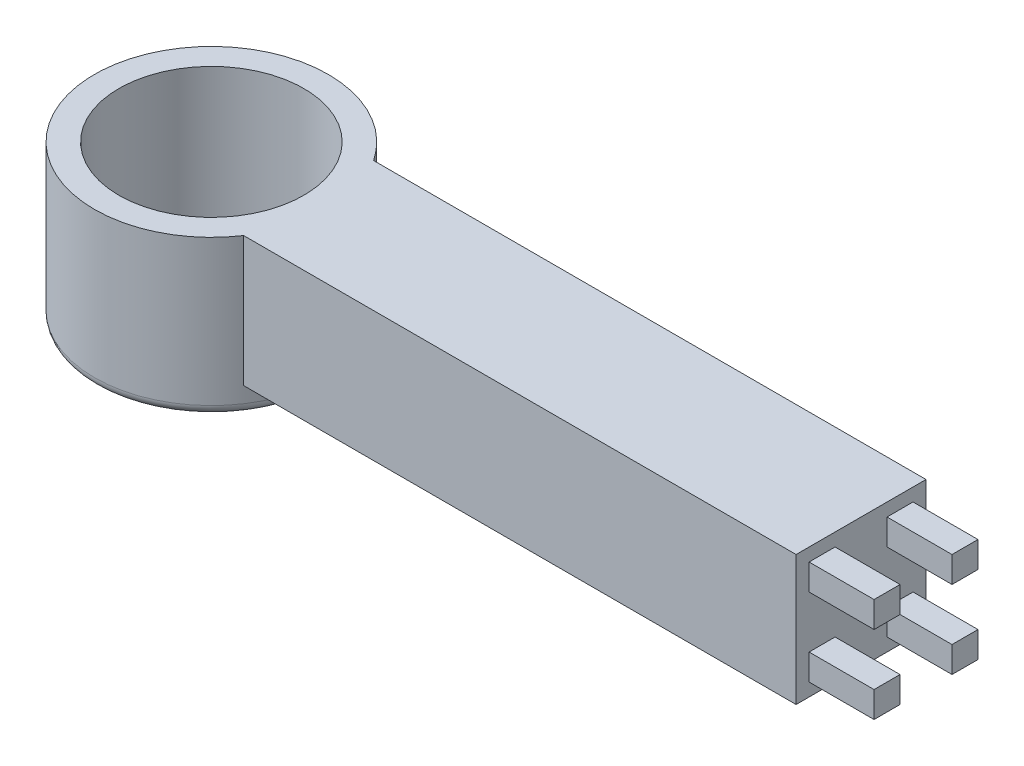
ISO-10303-21;
HEADER;
FILE_DESCRIPTION(('STEP AP214'),'2;1');
FILE_NAME('part.step','',(''),(''),'','','');
FILE_SCHEMA(('AUTOMOTIVE_DESIGN { 1 0 10303 214 1 1 1 1 }'));
ENDSEC;
DATA;
#1=APPLICATION_CONTEXT('core data for automotive mechanical design processes');
#2=APPLICATION_PROTOCOL_DEFINITION('international standard','automotive_design',2000,#1);
#3=PRODUCT_CONTEXT('',#1,'mechanical');
#4=PRODUCT('Part','Part','',(#3));
#5=PRODUCT_RELATED_PRODUCT_CATEGORY('part','',(#4));
#6=PRODUCT_DEFINITION_FORMATION('','',#4);
#7=PRODUCT_DEFINITION_CONTEXT('part definition',#1,'design');
#8=PRODUCT_DEFINITION('design','',#6,#7);
#9=PRODUCT_DEFINITION_SHAPE('','',#8);
#10=(LENGTH_UNIT() NAMED_UNIT(*) SI_UNIT(.MILLI.,.METRE.));
#11=(NAMED_UNIT(*) PLANE_ANGLE_UNIT() SI_UNIT($,.RADIAN.));
#12=(NAMED_UNIT(*) SI_UNIT($,.STERADIAN.) SOLID_ANGLE_UNIT());
#13=UNCERTAINTY_MEASURE_WITH_UNIT(LENGTH_MEASURE(1.E-05),#10,'distance_accuracy_value','');
#14=(GEOMETRIC_REPRESENTATION_CONTEXT(3) GLOBAL_UNCERTAINTY_ASSIGNED_CONTEXT((#13)) GLOBAL_UNIT_ASSIGNED_CONTEXT((#10,
#11,#12)) REPRESENTATION_CONTEXT('',''));
#15=CARTESIAN_POINT('',(0.,0.,0.));
#16=DIRECTION('',(0.,0.,1.));
#17=DIRECTION('',(1.,0.,0.));
#18=AXIS2_PLACEMENT_3D('',#15,#16,#17);
#19=CARTESIAN_POINT('',(635.,0.,127.));
#20=DIRECTION('',(-1.,0.,0.));
#21=DIRECTION('',(0.,0.,1.));
#22=AXIS2_PLACEMENT_3D('',#19,#20,#21);
#23=PLANE('',#22);
#24=DIRECTION('',(0.,1.,0.));
#25=VECTOR('',#24,1.);
#26=CARTESIAN_POINT('',(635.,88.9,88.9));
#27=LINE('',#26,#25);
#28=CARTESIAN_POINT('',(635.,88.9,88.9));
#29=VERTEX_POINT('',#28);
#30=CARTESIAN_POINT('',(635.,114.3,88.9));
#31=VERTEX_POINT('',#30);
#32=EDGE_CURVE('E191',#29,#31,#27,.T.);
#33=ORIENTED_EDGE('',*,*,#32,.F.);
#34=DIRECTION('',(0.,0.,-1.));
#35=VECTOR('',#34,1.);
#36=CARTESIAN_POINT('',(635.,88.9,114.3));
#37=LINE('',#36,#35);
#38=CARTESIAN_POINT('',(635.,88.9,114.3));
#39=VERTEX_POINT('',#38);
#40=EDGE_CURVE('E204',#39,#29,#37,.T.);
#41=ORIENTED_EDGE('',*,*,#40,.F.);
#42=DIRECTION('',(0.,-1.,0.));
#43=VECTOR('',#42,1.);
#44=CARTESIAN_POINT('',(635.,88.9,114.3));
#45=LINE('',#44,#43);
#46=CARTESIAN_POINT('',(635.,114.3,114.3));
#47=VERTEX_POINT('',#46);
#48=EDGE_CURVE('E213',#47,#39,#45,.T.);
#49=ORIENTED_EDGE('',*,*,#48,.F.);
#50=DIRECTION('',(0.,0.,1.));
#51=VECTOR('',#50,1.);
#52=CARTESIAN_POINT('',(635.,114.3,114.3));
#53=LINE('',#52,#51);
#54=EDGE_CURVE('E194',#31,#47,#53,.T.);
#55=ORIENTED_EDGE('',*,*,#54,.F.);
#56=EDGE_LOOP('',(#33,#41,#49,#55));
#57=FACE_BOUND('',#56,.T.);
#58=DIRECTION('',(0.,-1.,0.));
#59=VECTOR('',#58,1.);
#60=CARTESIAN_POINT('',(635.,12.7,114.3));
#61=LINE('',#60,#59);
#62=CARTESIAN_POINT('',(635.,38.1,114.3));
#63=VERTEX_POINT('',#62);
#64=CARTESIAN_POINT('',(635.,12.7,114.3));
#65=VERTEX_POINT('',#64);
#66=EDGE_CURVE('E262',#63,#65,#61,.T.);
#67=ORIENTED_EDGE('',*,*,#66,.F.);
#68=DIRECTION('',(0.,0.,1.));
#69=VECTOR('',#68,1.);
#70=CARTESIAN_POINT('',(635.,38.1,114.3));
#71=LINE('',#70,#69);
#72=CARTESIAN_POINT('',(635.,38.1,88.9));
#73=VERTEX_POINT('',#72);
#74=EDGE_CURVE('E267',#73,#63,#71,.T.);
#75=ORIENTED_EDGE('',*,*,#74,.F.);
#76=DIRECTION('',(0.,1.,0.));
#77=VECTOR('',#76,1.);
#78=CARTESIAN_POINT('',(635.,12.7,88.9));
#79=LINE('',#78,#77);
#80=CARTESIAN_POINT('',(635.,12.7,88.9));
#81=VERTEX_POINT('',#80);
#82=EDGE_CURVE('E279',#81,#73,#79,.T.);
#83=ORIENTED_EDGE('',*,*,#82,.F.);
#84=DIRECTION('',(0.,0.,-1.));
#85=VECTOR('',#84,1.);
#86=CARTESIAN_POINT('',(635.,12.7,114.3));
#87=LINE('',#86,#85);
#88=EDGE_CURVE('E276',#65,#81,#87,.T.);
#89=ORIENTED_EDGE('',*,*,#88,.F.);
#90=EDGE_LOOP('',(#67,#75,#83,#89));
#91=FACE_BOUND('',#90,.T.);
#92=DIRECTION('',(0.,1.,0.));
#93=VECTOR('',#92,1.);
#94=CARTESIAN_POINT('',(635.,0.,0.));
#95=LINE('',#94,#93);
#96=CARTESIAN_POINT('',(635.,0.,0.));
#97=VERTEX_POINT('',#96);
#98=CARTESIAN_POINT('',(635.,127.,0.));
#99=VERTEX_POINT('',#98);
#100=EDGE_CURVE('E318',#97,#99,#95,.T.);
#101=ORIENTED_EDGE('',*,*,#100,.T.);
#102=DIRECTION('',(0.,0.,-1.));
#103=VECTOR('',#102,1.);
#104=CARTESIAN_POINT('',(635.,127.,127.));
#105=LINE('',#104,#103);
#106=CARTESIAN_POINT('',(635.,127.,127.));
#107=VERTEX_POINT('',#106);
#108=EDGE_CURVE('E316',#107,#99,#105,.T.);
#109=ORIENTED_EDGE('',*,*,#108,.F.);
#110=DIRECTION('',(0.,1.,0.));
#111=VECTOR('',#110,1.);
#112=CARTESIAN_POINT('',(635.,0.,127.));
#113=LINE('',#112,#111);
#114=CARTESIAN_POINT('',(635.,0.,127.));
#115=VERTEX_POINT('',#114);
#116=EDGE_CURVE('E310',#115,#107,#113,.T.);
#117=ORIENTED_EDGE('',*,*,#116,.F.);
#118=DIRECTION('',(0.,0.,-1.));
#119=VECTOR('',#118,1.);
#120=CARTESIAN_POINT('',(635.,0.,127.));
#121=LINE('',#120,#119);
#122=EDGE_CURVE('E324',#115,#97,#121,.T.);
#123=ORIENTED_EDGE('',*,*,#122,.T.);
#124=EDGE_LOOP('',(#101,#109,#117,#123));
#125=FACE_BOUND('',#124,.T.);
#126=DIRECTION('',(0.,1.,0.));
#127=VECTOR('',#126,1.);
#128=CARTESIAN_POINT('',(635.,12.7,12.7));
#129=LINE('',#128,#127);
#130=CARTESIAN_POINT('',(635.,12.7,12.7));
#131=VERTEX_POINT('',#130);
#132=CARTESIAN_POINT('',(635.,38.1,12.7));
#133=VERTEX_POINT('',#132);
#134=EDGE_CURVE('E229',#131,#133,#129,.T.);
#135=ORIENTED_EDGE('',*,*,#134,.F.);
#136=DIRECTION('',(0.,0.,-1.));
#137=VECTOR('',#136,1.);
#138=CARTESIAN_POINT('',(635.,12.7,12.7));
#139=LINE('',#138,#137);
#140=CARTESIAN_POINT('',(635.,12.7,38.1));
#141=VERTEX_POINT('',#140);
#142=EDGE_CURVE('E234',#141,#131,#139,.T.);
#143=ORIENTED_EDGE('',*,*,#142,.F.);
#144=DIRECTION('',(0.,-1.,0.));
#145=VECTOR('',#144,1.);
#146=CARTESIAN_POINT('',(635.,12.7,38.1));
#147=LINE('',#146,#145);
#148=CARTESIAN_POINT('',(635.,38.1,38.1));
#149=VERTEX_POINT('',#148);
#150=EDGE_CURVE('E246',#149,#141,#147,.T.);
#151=ORIENTED_EDGE('',*,*,#150,.F.);
#152=DIRECTION('',(0.,0.,1.));
#153=VECTOR('',#152,1.);
#154=CARTESIAN_POINT('',(635.,38.1,12.7));
#155=LINE('',#154,#153);
#156=EDGE_CURVE('E243',#133,#149,#155,.T.);
#157=ORIENTED_EDGE('',*,*,#156,.F.);
#158=EDGE_LOOP('',(#135,#143,#151,#157));
#159=FACE_BOUND('',#158,.T.);
#160=DIRECTION('',(0.,1.,0.));
#161=VECTOR('',#160,1.);
#162=CARTESIAN_POINT('',(635.,114.3,12.7));
#163=LINE('',#162,#161);
#164=CARTESIAN_POINT('',(635.,88.9,12.7));
#165=VERTEX_POINT('',#164);
#166=CARTESIAN_POINT('',(635.,114.3,12.7));
#167=VERTEX_POINT('',#166);
#168=EDGE_CURVE('E190',#165,#167,#163,.T.);
#169=ORIENTED_EDGE('',*,*,#168,.F.);
#170=DIRECTION('',(0.,0.,-1.));
#171=VECTOR('',#170,1.);
#172=CARTESIAN_POINT('',(635.,88.9,12.7));
#173=LINE('',#172,#171);
#174=CARTESIAN_POINT('',(635.,88.9,38.1));
#175=VERTEX_POINT('',#174);
#176=EDGE_CURVE('E187',#175,#165,#173,.T.);
#177=ORIENTED_EDGE('',*,*,#176,.F.);
#178=DIRECTION('',(0.,-1.,0.));
#179=VECTOR('',#178,1.);
#180=CARTESIAN_POINT('',(635.,114.3,38.1));
#181=LINE('',#180,#179);
#182=CARTESIAN_POINT('',(635.,114.3,38.1));
#183=VERTEX_POINT('',#182);
#184=EDGE_CURVE('E53',#183,#175,#181,.T.);
#185=ORIENTED_EDGE('',*,*,#184,.F.);
#186=DIRECTION('',(0.,0.,1.));
#187=VECTOR('',#186,1.);
#188=CARTESIAN_POINT('',(635.,114.3,12.7));
#189=LINE('',#188,#187);
#190=EDGE_CURVE('E48',#167,#183,#189,.T.);
#191=ORIENTED_EDGE('',*,*,#190,.F.);
#192=EDGE_LOOP('',(#169,#177,#185,#191));
#193=FACE_BOUND('',#192,.T.);
#194=ADVANCED_FACE('F33',(#57,#91,#125,#159,#193),#23,.F.);
#195=CARTESIAN_POINT('',(0.,0.,127.));
#196=DIRECTION('',(0.,1.,0.));
#197=DIRECTION('',(0.,0.,1.));
#198=AXIS2_PLACEMENT_3D('',#195,#196,#197);
#199=PLANE('',#198);
#200=DIRECTION('',(1.,0.,0.));
#201=VECTOR('',#200,1.);
#202=CARTESIAN_POINT('',(0.,0.,127.));
#203=LINE('',#202,#201);
#204=CARTESIAN_POINT('',(95.0380976240581,0.,127.));
#205=VERTEX_POINT('',#204);
#206=EDGE_CURVE('E308',#205,#115,#203,.T.);
#207=ORIENTED_EDGE('',*,*,#206,.F.);
#208=CARTESIAN_POINT('',(0.,0.,63.5));
#209=DIRECTION('',(0.,1.,0.));
#210=DIRECTION('',(0.,0.,1.));
#211=AXIS2_PLACEMENT_3D('',#208,#209,#210);
#212=CIRCLE('',#211,114.3);
#213=CARTESIAN_POINT('',(95.0380976240581,0.,0.));
#214=VERTEX_POINT('',#213);
#215=EDGE_CURVE('E301',#205,#214,#212,.T.);
#216=ORIENTED_EDGE('',*,*,#215,.T.);
#217=DIRECTION('',(1.,0.,0.));
#218=VECTOR('',#217,1.);
#219=CARTESIAN_POINT('',(0.,0.,0.));
#220=LINE('',#219,#218);
#221=EDGE_CURVE('E307',#214,#97,#220,.T.);
#222=ORIENTED_EDGE('',*,*,#221,.T.);
#223=ORIENTED_EDGE('',*,*,#122,.F.);
#224=EDGE_LOOP('',(#207,#216,#222,#223));
#225=FACE_BOUND('',#224,.T.);
#226=ADVANCED_FACE('F379',(#225),#199,.F.);
#227=CARTESIAN_POINT('',(0.,127.,127.));
#228=DIRECTION('',(0.,-1.,0.));
#229=DIRECTION('',(0.,0.,-1.));
#230=AXIS2_PLACEMENT_3D('',#227,#228,#229);
#231=PLANE('',#230);
#232=DIRECTION('',(-1.,0.,0.));
#233=VECTOR('',#232,1.);
#234=CARTESIAN_POINT('',(0.,127.,0.));
#235=LINE('',#234,#233);
#236=CARTESIAN_POINT('',(95.0380976240581,127.,0.));
#237=VERTEX_POINT('',#236);
#238=EDGE_CURVE('E311',#99,#237,#235,.T.);
#239=ORIENTED_EDGE('',*,*,#238,.T.);
#240=CARTESIAN_POINT('',(0.,127.,63.5));
#241=DIRECTION('',(0.,1.,0.));
#242=DIRECTION('',(0.,0.,1.));
#243=AXIS2_PLACEMENT_3D('',#240,#241,#242);
#244=CIRCLE('',#243,114.3);
#245=CARTESIAN_POINT('',(95.0380976240581,127.,127.));
#246=VERTEX_POINT('',#245);
#247=EDGE_CURVE('E298',#237,#246,#244,.T.);
#248=ORIENTED_EDGE('',*,*,#247,.T.);
#249=DIRECTION('',(-1.,0.,0.));
#250=VECTOR('',#249,1.);
#251=CARTESIAN_POINT('',(0.,127.,127.));
#252=LINE('',#251,#250);
#253=EDGE_CURVE('E313',#107,#246,#252,.T.);
#254=ORIENTED_EDGE('',*,*,#253,.F.);
#255=ORIENTED_EDGE('',*,*,#108,.T.);
#256=EDGE_LOOP('',(#239,#248,#254,#255));
#257=FACE_BOUND('',#256,.T.);
#258=CARTESIAN_POINT('',(0.,127.,63.5));
#259=DIRECTION('',(0.,1.,0.));
#260=DIRECTION('',(0.,0.,1.));
#261=AXIS2_PLACEMENT_3D('',#258,#259,#260);
#262=CIRCLE('',#261,90.424);
#263=CARTESIAN_POINT('',(0.,127.,153.924));
#264=VERTEX_POINT('',#263);
#265=EDGE_CURVE('E295',#264,#264,#262,.T.);
#266=ORIENTED_EDGE('',*,*,#265,.F.);
#267=EDGE_LOOP('',(#266));
#268=FACE_BOUND('',#267,.T.);
#269=ADVANCED_FACE('F366',(#257,#268),#231,.F.);
#270=CARTESIAN_POINT('',(0.,0.,127.));
#271=DIRECTION('',(0.,0.,-1.));
#272=DIRECTION('',(-1.,0.,0.));
#273=AXIS2_PLACEMENT_3D('',#270,#271,#272);
#274=PLANE('',#273);
#275=ORIENTED_EDGE('',*,*,#253,.T.);
#276=DIRECTION('',(0.,1.,0.));
#277=VECTOR('',#276,1.);
#278=CARTESIAN_POINT('',(95.0380976240581,-25.3999999999998,127.));
#279=LINE('',#278,#277);
#280=EDGE_CURVE('E304',#246,#205,#279,.F.);
#281=ORIENTED_EDGE('',*,*,#280,.T.);
#282=ORIENTED_EDGE('',*,*,#206,.T.);
#283=ORIENTED_EDGE('',*,*,#116,.T.);
#284=EDGE_LOOP('',(#275,#281,#282,#283));
#285=FACE_BOUND('',#284,.T.);
#286=ADVANCED_FACE('F369',(#285),#274,.F.);
#287=CARTESIAN_POINT('',(0.,0.,0.));
#288=DIRECTION('',(0.,0.,-1.));
#289=DIRECTION('',(-1.,0.,0.));
#290=AXIS2_PLACEMENT_3D('',#287,#288,#289);
#291=PLANE('',#290);
#292=DIRECTION('',(0.,1.,0.));
#293=VECTOR('',#292,1.);
#294=CARTESIAN_POINT('',(95.0380976240581,-25.3999999999998,0.));
#295=LINE('',#294,#293);
#296=EDGE_CURVE('E327',#237,#214,#295,.F.);
#297=ORIENTED_EDGE('',*,*,#296,.F.);
#298=ORIENTED_EDGE('',*,*,#238,.F.);
#299=ORIENTED_EDGE('',*,*,#100,.F.);
#300=ORIENTED_EDGE('',*,*,#221,.F.);
#301=EDGE_LOOP('',(#297,#298,#299,#300));
#302=FACE_BOUND('',#301,.T.);
#303=ADVANCED_FACE('F359',(#302),#291,.T.);
#304=CARTESIAN_POINT('',(0.,-25.3999999999998,63.5));
#305=DIRECTION('',(0.,1.,0.));
#306=DIRECTION('',(0.,0.,1.));
#307=AXIS2_PLACEMENT_3D('',#304,#305,#306);
#308=CYLINDRICAL_SURFACE('',#307,114.3);
#309=CARTESIAN_POINT('',(0.,-15.3999999999998,63.5));
#310=DIRECTION('',(0.,1.,0.));
#311=DIRECTION('',(0.,0.,1.));
#312=AXIS2_PLACEMENT_3D('',#309,#310,#311);
#313=CIRCLE('',#312,114.3);
#314=CARTESIAN_POINT('',(0.,-15.3999999999998,177.8));
#315=VERTEX_POINT('',#314);
#316=EDGE_CURVE('E11',#315,#315,#313,.T.);
#317=ORIENTED_EDGE('',*,*,#316,.T.);
#318=EDGE_LOOP('',(#317));
#319=FACE_BOUND('',#318,.T.);
#320=ORIENTED_EDGE('',*,*,#280,.F.);
#321=ORIENTED_EDGE('',*,*,#247,.F.);
#322=ORIENTED_EDGE('',*,*,#296,.T.);
#323=ORIENTED_EDGE('',*,*,#215,.F.);
#324=EDGE_LOOP('',(#320,#321,#322,#323));
#325=FACE_BOUND('',#324,.T.);
#326=ADVANCED_FACE('F356',(#319,#325),#308,.T.);
#327=CARTESIAN_POINT('',(0.,-25.3999999999998,63.5));
#328=DIRECTION('',(0.,1.,0.));
#329=DIRECTION('',(0.,0.,1.));
#330=AXIS2_PLACEMENT_3D('',#327,#328,#329);
#331=CYLINDRICAL_SURFACE('',#330,90.424);
#332=CARTESIAN_POINT('',(0.,-15.3999999999998,63.5));
#333=DIRECTION('',(0.,1.,0.));
#334=DIRECTION('',(0.,0.,1.));
#335=AXIS2_PLACEMENT_3D('',#332,#333,#334);
#336=CIRCLE('',#335,90.424);
#337=CARTESIAN_POINT('',(0.,-15.3999999999998,153.924));
#338=VERTEX_POINT('',#337);
#339=EDGE_CURVE('E41',#338,#338,#336,.F.);
#340=ORIENTED_EDGE('',*,*,#339,.T.);
#341=EDGE_LOOP('',(#340));
#342=FACE_BOUND('',#341,.T.);
#343=ORIENTED_EDGE('',*,*,#265,.T.);
#344=EDGE_LOOP('',(#343));
#345=FACE_BOUND('',#344,.T.);
#346=ADVANCED_FACE('F337',(#342,#345),#331,.F.);
#347=CARTESIAN_POINT('',(0.,-25.3999999999998,63.5));
#348=DIRECTION('',(0.,1.,0.));
#349=DIRECTION('',(0.,0.,1.));
#350=AXIS2_PLACEMENT_3D('',#347,#348,#349);
#351=PLANE('',#350);
#352=CARTESIAN_POINT('',(0.,-25.3999999999998,63.5));
#353=DIRECTION('',(0.,1.,0.));
#354=DIRECTION('',(0.,0.,1.));
#355=AXIS2_PLACEMENT_3D('',#352,#353,#354);
#356=CIRCLE('',#355,100.424);
#357=CARTESIAN_POINT('',(0.,-25.3999999999998,163.924));
#358=VERTEX_POINT('',#357);
#359=EDGE_CURVE('E332',#358,#358,#356,.T.);
#360=ORIENTED_EDGE('',*,*,#359,.T.);
#361=EDGE_LOOP('',(#360));
#362=FACE_BOUND('',#361,.T.);
#363=CARTESIAN_POINT('',(0.,-25.3999999999998,63.5));
#364=DIRECTION('',(0.,1.,0.));
#365=DIRECTION('',(0.,0.,1.));
#366=AXIS2_PLACEMENT_3D('',#363,#364,#365);
#367=CIRCLE('',#366,104.3);
#368=CARTESIAN_POINT('',(0.,-25.3999999999998,167.8));
#369=VERTEX_POINT('',#368);
#370=EDGE_CURVE('E329',#369,#369,#367,.F.);
#371=ORIENTED_EDGE('',*,*,#370,.T.);
#372=EDGE_LOOP('',(#371));
#373=FACE_BOUND('',#372,.T.);
#374=ADVANCED_FACE('F345',(#362,#373),#351,.F.);
#375=CARTESIAN_POINT('',(698.5,12.7,114.3));
#376=DIRECTION('',(0.,0.,-1.));
#377=DIRECTION('',(-1.,0.,0.));
#378=AXIS2_PLACEMENT_3D('',#375,#376,#377);
#379=PLANE('',#378);
#380=ORIENTED_EDGE('',*,*,#66,.T.);
#381=DIRECTION('',(-1.,0.,0.));
#382=VECTOR('',#381,1.);
#383=CARTESIAN_POINT('',(698.5,12.7,114.3));
#384=LINE('',#383,#382);
#385=CARTESIAN_POINT('',(698.5,12.7,114.3));
#386=VERTEX_POINT('',#385);
#387=EDGE_CURVE('E292',#386,#65,#384,.T.);
#388=ORIENTED_EDGE('',*,*,#387,.F.);
#389=DIRECTION('',(0.,-1.,0.));
#390=VECTOR('',#389,1.);
#391=CARTESIAN_POINT('',(698.5,12.7,114.3));
#392=LINE('',#391,#390);
#393=CARTESIAN_POINT('',(698.5,38.1,114.3));
#394=VERTEX_POINT('',#393);
#395=EDGE_CURVE('E263',#394,#386,#392,.T.);
#396=ORIENTED_EDGE('',*,*,#395,.F.);
#397=DIRECTION('',(-1.,0.,0.));
#398=VECTOR('',#397,1.);
#399=CARTESIAN_POINT('',(698.5,38.1,114.3));
#400=LINE('',#399,#398);
#401=EDGE_CURVE('E273',#394,#63,#400,.T.);
#402=ORIENTED_EDGE('',*,*,#401,.T.);
#403=EDGE_LOOP('',(#380,#388,#396,#402));
#404=FACE_BOUND('',#403,.T.);
#405=ADVANCED_FACE('F348',(#404),#379,.F.);
#406=CARTESIAN_POINT('',(698.5,12.7,114.3));
#407=DIRECTION('',(0.,1.,0.));
#408=DIRECTION('',(0.,0.,1.));
#409=AXIS2_PLACEMENT_3D('',#406,#407,#408);
#410=PLANE('',#409);
#411=ORIENTED_EDGE('',*,*,#88,.T.);
#412=DIRECTION('',(-1.,0.,0.));
#413=VECTOR('',#412,1.);
#414=CARTESIAN_POINT('',(698.5,12.7,88.9));
#415=LINE('',#414,#413);
#416=CARTESIAN_POINT('',(698.5,12.7,88.9));
#417=VERTEX_POINT('',#416);
#418=EDGE_CURVE('E289',#417,#81,#415,.T.);
#419=ORIENTED_EDGE('',*,*,#418,.F.);
#420=DIRECTION('',(0.,0.,-1.));
#421=VECTOR('',#420,1.);
#422=CARTESIAN_POINT('',(698.5,12.7,114.3));
#423=LINE('',#422,#421);
#424=EDGE_CURVE('E266',#386,#417,#423,.T.);
#425=ORIENTED_EDGE('',*,*,#424,.F.);
#426=ORIENTED_EDGE('',*,*,#387,.T.);
#427=EDGE_LOOP('',(#411,#419,#425,#426));
#428=FACE_BOUND('',#427,.T.);
#429=ADVANCED_FACE('F398',(#428),#410,.F.);
#430=CARTESIAN_POINT('',(698.5,12.7,88.9));
#431=DIRECTION('',(0.,0.,1.));
#432=DIRECTION('',(1.,0.,0.));
#433=AXIS2_PLACEMENT_3D('',#430,#431,#432);
#434=PLANE('',#433);
#435=ORIENTED_EDGE('',*,*,#82,.T.);
#436=DIRECTION('',(-1.,0.,0.));
#437=VECTOR('',#436,1.);
#438=CARTESIAN_POINT('',(698.5,38.1,88.9));
#439=LINE('',#438,#437);
#440=CARTESIAN_POINT('',(698.5,38.1,88.9));
#441=VERTEX_POINT('',#440);
#442=EDGE_CURVE('E286',#441,#73,#439,.T.);
#443=ORIENTED_EDGE('',*,*,#442,.F.);
#444=DIRECTION('',(0.,1.,0.));
#445=VECTOR('',#444,1.);
#446=CARTESIAN_POINT('',(698.5,12.7,88.9));
#447=LINE('',#446,#445);
#448=EDGE_CURVE('E269',#417,#441,#447,.T.);
#449=ORIENTED_EDGE('',*,*,#448,.F.);
#450=ORIENTED_EDGE('',*,*,#418,.T.);
#451=EDGE_LOOP('',(#435,#443,#449,#450));
#452=FACE_BOUND('',#451,.T.);
#453=ADVANCED_FACE('F402',(#452),#434,.F.);
#454=CARTESIAN_POINT('',(698.5,38.1,114.3));
#455=DIRECTION('',(0.,-1.,0.));
#456=DIRECTION('',(0.,0.,-1.));
#457=AXIS2_PLACEMENT_3D('',#454,#455,#456);
#458=PLANE('',#457);
#459=ORIENTED_EDGE('',*,*,#74,.T.);
#460=ORIENTED_EDGE('',*,*,#401,.F.);
#461=DIRECTION('',(0.,0.,1.));
#462=VECTOR('',#461,1.);
#463=CARTESIAN_POINT('',(698.5,38.1,114.3));
#464=LINE('',#463,#462);
#465=EDGE_CURVE('E271',#441,#394,#464,.T.);
#466=ORIENTED_EDGE('',*,*,#465,.F.);
#467=ORIENTED_EDGE('',*,*,#442,.T.);
#468=EDGE_LOOP('',(#459,#460,#466,#467));
#469=FACE_BOUND('',#468,.T.);
#470=ADVANCED_FACE('F406',(#469),#458,.F.);
#471=CARTESIAN_POINT('',(698.5,0.,0.));
#472=DIRECTION('',(-1.,0.,0.));
#473=DIRECTION('',(0.,0.,1.));
#474=AXIS2_PLACEMENT_3D('',#471,#472,#473);
#475=PLANE('',#474);
#476=ORIENTED_EDGE('',*,*,#395,.T.);
#477=ORIENTED_EDGE('',*,*,#424,.T.);
#478=ORIENTED_EDGE('',*,*,#448,.T.);
#479=ORIENTED_EDGE('',*,*,#465,.T.);
#480=EDGE_LOOP('',(#476,#477,#478,#479));
#481=FACE_BOUND('',#480,.T.);
#482=ADVANCED_FACE('F410',(#481),#475,.F.);
#483=CARTESIAN_POINT('',(698.5,12.7,12.7));
#484=DIRECTION('',(0.,0.,1.));
#485=DIRECTION('',(0.,-1.,0.));
#486=AXIS2_PLACEMENT_3D('',#483,#484,#485);
#487=PLANE('',#486);
#488=ORIENTED_EDGE('',*,*,#134,.T.);
#489=DIRECTION('',(-1.,0.,0.));
#490=VECTOR('',#489,1.);
#491=CARTESIAN_POINT('',(698.5,38.1,12.7));
#492=LINE('',#491,#490);
#493=CARTESIAN_POINT('',(698.5,38.1,12.7));
#494=VERTEX_POINT('',#493);
#495=EDGE_CURVE('E259',#494,#133,#492,.T.);
#496=ORIENTED_EDGE('',*,*,#495,.F.);
#497=DIRECTION('',(0.,1.,0.));
#498=VECTOR('',#497,1.);
#499=CARTESIAN_POINT('',(698.5,12.7,12.7));
#500=LINE('',#499,#498);
#501=CARTESIAN_POINT('',(698.5,12.7,12.7));
#502=VERTEX_POINT('',#501);
#503=EDGE_CURVE('E230',#502,#494,#500,.T.);
#504=ORIENTED_EDGE('',*,*,#503,.F.);
#505=DIRECTION('',(-1.,0.,0.));
#506=VECTOR('',#505,1.);
#507=CARTESIAN_POINT('',(698.5,12.7,12.7));
#508=LINE('',#507,#506);
#509=EDGE_CURVE('E240',#502,#131,#508,.T.);
#510=ORIENTED_EDGE('',*,*,#509,.T.);
#511=EDGE_LOOP('',(#488,#496,#504,#510));
#512=FACE_BOUND('',#511,.T.);
#513=ADVANCED_FACE('F414',(#512),#487,.F.);
#514=CARTESIAN_POINT('',(698.5,38.1,12.7));
#515=DIRECTION('',(0.,-1.,0.));
#516=DIRECTION('',(0.,0.,-1.));
#517=AXIS2_PLACEMENT_3D('',#514,#515,#516);
#518=PLANE('',#517);
#519=ORIENTED_EDGE('',*,*,#156,.T.);
#520=DIRECTION('',(-1.,0.,0.));
#521=VECTOR('',#520,1.);
#522=CARTESIAN_POINT('',(698.5,38.1,38.1));
#523=LINE('',#522,#521);
#524=CARTESIAN_POINT('',(698.5,38.1,38.1));
#525=VERTEX_POINT('',#524);
#526=EDGE_CURVE('E256',#525,#149,#523,.T.);
#527=ORIENTED_EDGE('',*,*,#526,.F.);
#528=DIRECTION('',(0.,0.,1.));
#529=VECTOR('',#528,1.);
#530=CARTESIAN_POINT('',(698.5,38.1,12.7));
#531=LINE('',#530,#529);
#532=EDGE_CURVE('E233',#494,#525,#531,.T.);
#533=ORIENTED_EDGE('',*,*,#532,.F.);
#534=ORIENTED_EDGE('',*,*,#495,.T.);
#535=EDGE_LOOP('',(#519,#527,#533,#534));
#536=FACE_BOUND('',#535,.T.);
#537=ADVANCED_FACE('F418',(#536),#518,.F.);
#538=CARTESIAN_POINT('',(698.5,12.7,38.1));
#539=DIRECTION('',(0.,0.,-1.));
#540=DIRECTION('',(-1.,0.,0.));
#541=AXIS2_PLACEMENT_3D('',#538,#539,#540);
#542=PLANE('',#541);
#543=ORIENTED_EDGE('',*,*,#150,.T.);
#544=DIRECTION('',(-1.,0.,0.));
#545=VECTOR('',#544,1.);
#546=CARTESIAN_POINT('',(698.5,12.7,38.1));
#547=LINE('',#546,#545);
#548=CARTESIAN_POINT('',(698.5,12.7,38.1));
#549=VERTEX_POINT('',#548);
#550=EDGE_CURVE('E253',#549,#141,#547,.T.);
#551=ORIENTED_EDGE('',*,*,#550,.F.);
#552=DIRECTION('',(0.,-1.,0.));
#553=VECTOR('',#552,1.);
#554=CARTESIAN_POINT('',(698.5,12.7,38.1));
#555=LINE('',#554,#553);
#556=EDGE_CURVE('E236',#525,#549,#555,.T.);
#557=ORIENTED_EDGE('',*,*,#556,.F.);
#558=ORIENTED_EDGE('',*,*,#526,.T.);
#559=EDGE_LOOP('',(#543,#551,#557,#558));
#560=FACE_BOUND('',#559,.T.);
#561=ADVANCED_FACE('F422',(#560),#542,.F.);
#562=CARTESIAN_POINT('',(698.5,12.7,12.7));
#563=DIRECTION('',(0.,1.,0.));
#564=DIRECTION('',(0.,0.,1.));
#565=AXIS2_PLACEMENT_3D('',#562,#563,#564);
#566=PLANE('',#565);
#567=ORIENTED_EDGE('',*,*,#142,.T.);
#568=ORIENTED_EDGE('',*,*,#509,.F.);
#569=DIRECTION('',(0.,0.,-1.));
#570=VECTOR('',#569,1.);
#571=CARTESIAN_POINT('',(698.5,12.7,12.7));
#572=LINE('',#571,#570);
#573=EDGE_CURVE('E238',#549,#502,#572,.T.);
#574=ORIENTED_EDGE('',*,*,#573,.F.);
#575=ORIENTED_EDGE('',*,*,#550,.T.);
#576=EDGE_LOOP('',(#567,#568,#574,#575));
#577=FACE_BOUND('',#576,.T.);
#578=ADVANCED_FACE('F426',(#577),#566,.F.);
#579=CARTESIAN_POINT('',(698.5,0.,0.));
#580=DIRECTION('',(1.,0.,0.));
#581=DIRECTION('',(0.,0.,-1.));
#582=AXIS2_PLACEMENT_3D('',#579,#580,#581);
#583=PLANE('',#582);
#584=ORIENTED_EDGE('',*,*,#503,.T.);
#585=ORIENTED_EDGE('',*,*,#532,.T.);
#586=ORIENTED_EDGE('',*,*,#556,.T.);
#587=ORIENTED_EDGE('',*,*,#573,.T.);
#588=EDGE_LOOP('',(#584,#585,#586,#587));
#589=FACE_BOUND('',#588,.T.);
#590=ADVANCED_FACE('F430',(#589),#583,.T.);
#591=CARTESIAN_POINT('',(698.5,88.9,88.9));
#592=DIRECTION('',(0.,0.,1.));
#593=DIRECTION('',(1.,0.,0.));
#594=AXIS2_PLACEMENT_3D('',#591,#592,#593);
#595=PLANE('',#594);
#596=ORIENTED_EDGE('',*,*,#32,.T.);
#597=DIRECTION('',(-1.,0.,0.));
#598=VECTOR('',#597,1.);
#599=CARTESIAN_POINT('',(698.5,114.3,88.9));
#600=LINE('',#599,#598);
#601=CARTESIAN_POINT('',(698.5,114.3,88.9));
#602=VERTEX_POINT('',#601);
#603=EDGE_CURVE('E226',#602,#31,#600,.T.);
#604=ORIENTED_EDGE('',*,*,#603,.F.);
#605=DIRECTION('',(0.,1.,0.));
#606=VECTOR('',#605,1.);
#607=CARTESIAN_POINT('',(698.5,88.9,88.9));
#608=LINE('',#607,#606);
#609=CARTESIAN_POINT('',(698.5,88.9,88.9));
#610=VERTEX_POINT('',#609);
#611=EDGE_CURVE('E200',#610,#602,#608,.T.);
#612=ORIENTED_EDGE('',*,*,#611,.F.);
#613=DIRECTION('',(-1.,0.,0.));
#614=VECTOR('',#613,1.);
#615=CARTESIAN_POINT('',(698.5,88.9,88.9));
#616=LINE('',#615,#614);
#617=EDGE_CURVE('E209',#610,#29,#616,.T.);
#618=ORIENTED_EDGE('',*,*,#617,.T.);
#619=EDGE_LOOP('',(#596,#604,#612,#618));
#620=FACE_BOUND('',#619,.T.);
#621=ADVANCED_FACE('F434',(#620),#595,.F.);
#622=CARTESIAN_POINT('',(698.5,114.3,114.3));
#623=DIRECTION('',(0.,-1.,0.));
#624=DIRECTION('',(0.,0.,-1.));
#625=AXIS2_PLACEMENT_3D('',#622,#623,#624);
#626=PLANE('',#625);
#627=ORIENTED_EDGE('',*,*,#54,.T.);
#628=DIRECTION('',(-1.,0.,0.));
#629=VECTOR('',#628,1.);
#630=CARTESIAN_POINT('',(698.5,114.3,114.3));
#631=LINE('',#630,#629);
#632=CARTESIAN_POINT('',(698.5,114.3,114.3));
#633=VERTEX_POINT('',#632);
#634=EDGE_CURVE('E223',#633,#47,#631,.T.);
#635=ORIENTED_EDGE('',*,*,#634,.F.);
#636=DIRECTION('',(0.,0.,1.));
#637=VECTOR('',#636,1.);
#638=CARTESIAN_POINT('',(698.5,114.3,114.3));
#639=LINE('',#638,#637);
#640=EDGE_CURVE('E203',#602,#633,#639,.T.);
#641=ORIENTED_EDGE('',*,*,#640,.F.);
#642=ORIENTED_EDGE('',*,*,#603,.T.);
#643=EDGE_LOOP('',(#627,#635,#641,#642));
#644=FACE_BOUND('',#643,.T.);
#645=ADVANCED_FACE('F438',(#644),#626,.F.);
#646=CARTESIAN_POINT('',(698.5,88.9,114.3));
#647=DIRECTION('',(0.,0.,-1.));
#648=DIRECTION('',(-1.,0.,0.));
#649=AXIS2_PLACEMENT_3D('',#646,#647,#648);
#650=PLANE('',#649);
#651=ORIENTED_EDGE('',*,*,#48,.T.);
#652=DIRECTION('',(-1.,0.,0.));
#653=VECTOR('',#652,1.);
#654=CARTESIAN_POINT('',(698.5,88.9,114.3));
#655=LINE('',#654,#653);
#656=CARTESIAN_POINT('',(698.5,88.9,114.3));
#657=VERTEX_POINT('',#656);
#658=EDGE_CURVE('E220',#657,#39,#655,.T.);
#659=ORIENTED_EDGE('',*,*,#658,.F.);
#660=DIRECTION('',(0.,-1.,0.));
#661=VECTOR('',#660,1.);
#662=CARTESIAN_POINT('',(698.5,88.9,114.3));
#663=LINE('',#662,#661);
#664=EDGE_CURVE('E206',#633,#657,#663,.T.);
#665=ORIENTED_EDGE('',*,*,#664,.F.);
#666=ORIENTED_EDGE('',*,*,#634,.T.);
#667=EDGE_LOOP('',(#651,#659,#665,#666));
#668=FACE_BOUND('',#667,.T.);
#669=ADVANCED_FACE('F442',(#668),#650,.F.);
#670=CARTESIAN_POINT('',(698.5,88.9,114.3));
#671=DIRECTION('',(0.,1.,0.));
#672=DIRECTION('',(0.,0.,1.));
#673=AXIS2_PLACEMENT_3D('',#670,#671,#672);
#674=PLANE('',#673);
#675=ORIENTED_EDGE('',*,*,#40,.T.);
#676=ORIENTED_EDGE('',*,*,#617,.F.);
#677=DIRECTION('',(0.,0.,-1.));
#678=VECTOR('',#677,1.);
#679=CARTESIAN_POINT('',(698.5,88.9,114.3));
#680=LINE('',#679,#678);
#681=EDGE_CURVE('E208',#657,#610,#680,.T.);
#682=ORIENTED_EDGE('',*,*,#681,.F.);
#683=ORIENTED_EDGE('',*,*,#658,.T.);
#684=EDGE_LOOP('',(#675,#676,#682,#683));
#685=FACE_BOUND('',#684,.T.);
#686=ADVANCED_FACE('F446',(#685),#674,.F.);
#687=CARTESIAN_POINT('',(698.5,0.,0.));
#688=DIRECTION('',(-1.,0.,0.));
#689=DIRECTION('',(0.,0.,1.));
#690=AXIS2_PLACEMENT_3D('',#687,#688,#689);
#691=PLANE('',#690);
#692=ORIENTED_EDGE('',*,*,#611,.T.);
#693=ORIENTED_EDGE('',*,*,#640,.T.);
#694=ORIENTED_EDGE('',*,*,#664,.T.);
#695=ORIENTED_EDGE('',*,*,#681,.T.);
#696=EDGE_LOOP('',(#692,#693,#694,#695));
#697=FACE_BOUND('',#696,.T.);
#698=ADVANCED_FACE('F450',(#697),#691,.F.);
#699=CARTESIAN_POINT('',(698.5,114.3,12.7));
#700=DIRECTION('',(0.,0.,1.));
#701=DIRECTION('',(0.,-1.,0.));
#702=AXIS2_PLACEMENT_3D('',#699,#700,#701);
#703=PLANE('',#702);
#704=ORIENTED_EDGE('',*,*,#168,.T.);
#705=DIRECTION('',(-1.,0.,0.));
#706=VECTOR('',#705,1.);
#707=CARTESIAN_POINT('',(698.5,114.3,12.7));
#708=LINE('',#707,#706);
#709=CARTESIAN_POINT('',(698.5,114.3,12.7));
#710=VERTEX_POINT('',#709);
#711=EDGE_CURVE('E171',#710,#167,#708,.T.);
#712=ORIENTED_EDGE('',*,*,#711,.F.);
#713=DIRECTION('',(0.,1.,0.));
#714=VECTOR('',#713,1.);
#715=CARTESIAN_POINT('',(698.5,114.3,12.7));
#716=LINE('',#715,#714);
#717=CARTESIAN_POINT('',(698.5,88.9,12.7));
#718=VERTEX_POINT('',#717);
#719=EDGE_CURVE('E178',#718,#710,#716,.T.);
#720=ORIENTED_EDGE('',*,*,#719,.F.);
#721=DIRECTION('',(-1.,0.,0.));
#722=VECTOR('',#721,1.);
#723=CARTESIAN_POINT('',(698.5,88.9,12.7));
#724=LINE('',#723,#722);
#725=EDGE_CURVE('E654',#718,#165,#724,.T.);
#726=ORIENTED_EDGE('',*,*,#725,.T.);
#727=EDGE_LOOP('',(#704,#712,#720,#726));
#728=FACE_BOUND('',#727,.T.);
#729=ADVANCED_FACE('F189',(#728),#703,.F.);
#730=CARTESIAN_POINT('',(698.5,114.3,12.7));
#731=DIRECTION('',(0.,-1.,0.));
#732=DIRECTION('',(0.,0.,-1.));
#733=AXIS2_PLACEMENT_3D('',#730,#731,#732);
#734=PLANE('',#733);
#735=ORIENTED_EDGE('',*,*,#190,.T.);
#736=DIRECTION('',(-1.,0.,0.));
#737=VECTOR('',#736,1.);
#738=CARTESIAN_POINT('',(698.5,114.3,38.1));
#739=LINE('',#738,#737);
#740=CARTESIAN_POINT('',(698.5,114.3,38.1));
#741=VERTEX_POINT('',#740);
#742=EDGE_CURVE('E174',#741,#183,#739,.T.);
#743=ORIENTED_EDGE('',*,*,#742,.F.);
#744=DIRECTION('',(0.,0.,1.));
#745=VECTOR('',#744,1.);
#746=CARTESIAN_POINT('',(698.5,114.3,12.7));
#747=LINE('',#746,#745);
#748=EDGE_CURVE('E167',#710,#741,#747,.T.);
#749=ORIENTED_EDGE('',*,*,#748,.F.);
#750=ORIENTED_EDGE('',*,*,#711,.T.);
#751=EDGE_LOOP('',(#735,#743,#749,#750));
#752=FACE_BOUND('',#751,.T.);
#753=ADVANCED_FACE('F169',(#752),#734,.F.);
#754=CARTESIAN_POINT('',(698.5,114.3,38.1));
#755=DIRECTION('',(0.,0.,-1.));
#756=DIRECTION('',(-1.,0.,0.));
#757=AXIS2_PLACEMENT_3D('',#754,#755,#756);
#758=PLANE('',#757);
#759=ORIENTED_EDGE('',*,*,#184,.T.);
#760=DIRECTION('',(-1.,0.,0.));
#761=VECTOR('',#760,1.);
#762=CARTESIAN_POINT('',(698.5,88.9,38.1));
#763=LINE('',#762,#761);
#764=CARTESIAN_POINT('',(698.5,88.9,38.1));
#765=VERTEX_POINT('',#764);
#766=EDGE_CURVE('E196',#765,#175,#763,.T.);
#767=ORIENTED_EDGE('',*,*,#766,.F.);
#768=DIRECTION('',(0.,-1.,0.));
#769=VECTOR('',#768,1.);
#770=CARTESIAN_POINT('',(698.5,114.3,38.1));
#771=LINE('',#770,#769);
#772=EDGE_CURVE('E177',#741,#765,#771,.T.);
#773=ORIENTED_EDGE('',*,*,#772,.F.);
#774=ORIENTED_EDGE('',*,*,#742,.T.);
#775=EDGE_LOOP('',(#759,#767,#773,#774));
#776=FACE_BOUND('',#775,.T.);
#777=ADVANCED_FACE('F459',(#776),#758,.F.);
#778=CARTESIAN_POINT('',(698.5,88.9,12.7));
#779=DIRECTION('',(0.,1.,0.));
#780=DIRECTION('',(0.,0.,1.));
#781=AXIS2_PLACEMENT_3D('',#778,#779,#780);
#782=PLANE('',#781);
#783=ORIENTED_EDGE('',*,*,#176,.T.);
#784=ORIENTED_EDGE('',*,*,#725,.F.);
#785=DIRECTION('',(0.,0.,-1.));
#786=VECTOR('',#785,1.);
#787=CARTESIAN_POINT('',(698.5,88.9,12.7));
#788=LINE('',#787,#786);
#789=EDGE_CURVE('E183',#765,#718,#788,.T.);
#790=ORIENTED_EDGE('',*,*,#789,.F.);
#791=ORIENTED_EDGE('',*,*,#766,.T.);
#792=EDGE_LOOP('',(#783,#784,#790,#791));
#793=FACE_BOUND('',#792,.T.);
#794=ADVANCED_FACE('F462',(#793),#782,.F.);
#795=CARTESIAN_POINT('',(698.5,0.,0.));
#796=DIRECTION('',(-1.,0.,0.));
#797=DIRECTION('',(0.,0.,1.));
#798=AXIS2_PLACEMENT_3D('',#795,#796,#797);
#799=PLANE('',#798);
#800=ORIENTED_EDGE('',*,*,#719,.T.);
#801=ORIENTED_EDGE('',*,*,#748,.T.);
#802=ORIENTED_EDGE('',*,*,#772,.T.);
#803=ORIENTED_EDGE('',*,*,#789,.T.);
#804=EDGE_LOOP('',(#800,#801,#802,#803));
#805=FACE_BOUND('',#804,.T.);
#806=ADVANCED_FACE('F181',(#805),#799,.F.);
#807=CARTESIAN_POINT('',(0.,-15.3999999999998,63.5));
#808=DIRECTION('',(0.,1.,0.));
#809=DIRECTION('',(0.,0.,1.));
#810=AXIS2_PLACEMENT_3D('',#807,#808,#809);
#811=TOROIDAL_SURFACE('',#810,100.424,10.);
#812=ORIENTED_EDGE('',*,*,#339,.F.);
#813=EDGE_LOOP('',(#812));
#814=FACE_BOUND('',#813,.T.);
#815=ORIENTED_EDGE('',*,*,#359,.F.);
#816=EDGE_LOOP('',(#815));
#817=FACE_BOUND('',#816,.T.);
#818=ADVANCED_FACE('F340',(#814,#817),#811,.T.);
#819=CARTESIAN_POINT('',(0.,-15.3999999999998,63.5));
#820=DIRECTION('',(0.,1.,0.));
#821=DIRECTION('',(0.,0.,1.));
#822=AXIS2_PLACEMENT_3D('',#819,#820,#821);
#823=TOROIDAL_SURFACE('',#822,104.3,10.);
#824=ORIENTED_EDGE('',*,*,#370,.F.);
#825=EDGE_LOOP('',(#824));
#826=FACE_BOUND('',#825,.T.);
#827=ORIENTED_EDGE('',*,*,#316,.F.);
#828=EDGE_LOOP('',(#827));
#829=FACE_BOUND('',#828,.T.);
#830=ADVANCED_FACE('F35',(#826,#829),#823,.T.);
#831=CLOSED_SHELL('',(#194,#226,#269,#286,#303,#326,#346,#374,#405,#429,#453,#470,#482,#513,
#537,#561,#578,#590,#621,#645,#669,#686,#698,#729,#753,#777,#794,#806,#818,#830));
#832=MANIFOLD_SOLID_BREP('B2',#831);
#833=ADVANCED_BREP_SHAPE_REPRESENTATION('',(#18,#832),#14);
#834=SHAPE_DEFINITION_REPRESENTATION(#9,#833);
ENDSEC;
END-ISO-10303-21;
